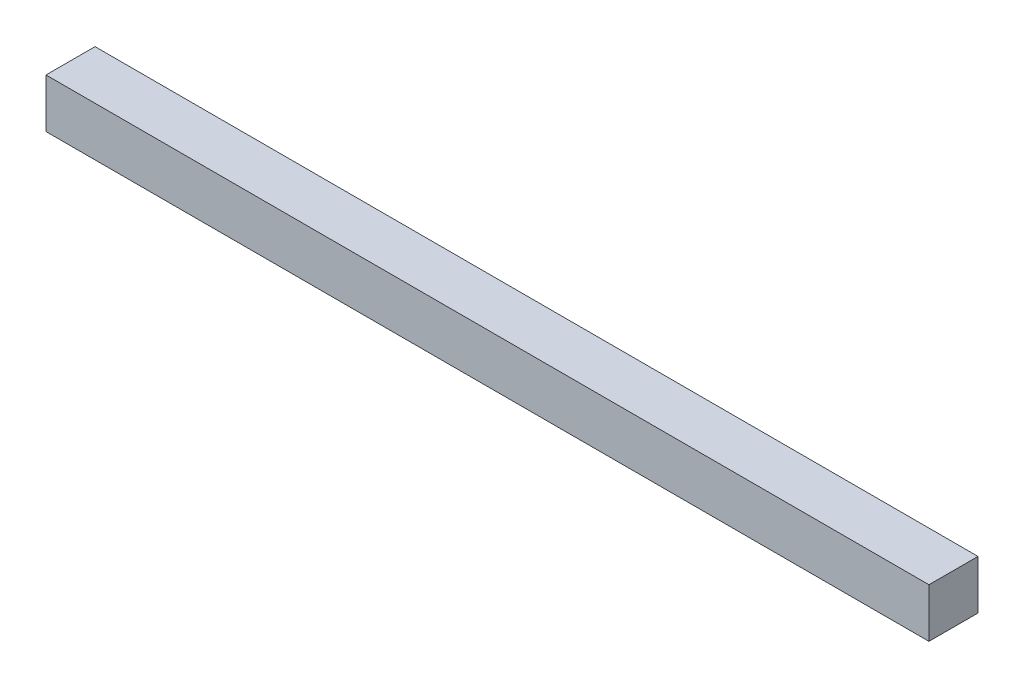
ISO-10303-21;
HEADER;
FILE_DESCRIPTION(('STEP AP214'),'2;1');
FILE_NAME('part.step','',(''),(''),'','','');
FILE_SCHEMA(('AUTOMOTIVE_DESIGN { 1 0 10303 214 1 1 1 1 }'));
ENDSEC;
DATA;
#1=APPLICATION_CONTEXT('core data for automotive mechanical design processes');
#2=APPLICATION_PROTOCOL_DEFINITION('international standard','automotive_design',2000,#1);
#3=PRODUCT_CONTEXT('',#1,'mechanical');
#4=PRODUCT('Part','Part','',(#3));
#5=PRODUCT_RELATED_PRODUCT_CATEGORY('part','',(#4));
#6=PRODUCT_DEFINITION_FORMATION('','',#4);
#7=PRODUCT_DEFINITION_CONTEXT('part definition',#1,'design');
#8=PRODUCT_DEFINITION('design','',#6,#7);
#9=PRODUCT_DEFINITION_SHAPE('','',#8);
#10=(LENGTH_UNIT() NAMED_UNIT(*) SI_UNIT(.MILLI.,.METRE.));
#11=(NAMED_UNIT(*) PLANE_ANGLE_UNIT() SI_UNIT($,.RADIAN.));
#12=(NAMED_UNIT(*) SI_UNIT($,.STERADIAN.) SOLID_ANGLE_UNIT());
#13=UNCERTAINTY_MEASURE_WITH_UNIT(LENGTH_MEASURE(1.E-05),#10,'distance_accuracy_value','');
#14=(GEOMETRIC_REPRESENTATION_CONTEXT(3) GLOBAL_UNCERTAINTY_ASSIGNED_CONTEXT((#13)) GLOBAL_UNIT_ASSIGNED_CONTEXT((#10,
#11,#12)) REPRESENTATION_CONTEXT('',''));
#15=CARTESIAN_POINT('',(0.,0.,0.));
#16=DIRECTION('',(0.,0.,1.));
#17=DIRECTION('',(1.,0.,0.));
#18=AXIS2_PLACEMENT_3D('',#15,#16,#17);
#19=CARTESIAN_POINT('',(685.8,19.05,-19.05));
#20=DIRECTION('',(0.,0.,1.));
#21=DIRECTION('',(0.,-1.,0.));
#22=AXIS2_PLACEMENT_3D('',#19,#20,#21);
#23=PLANE('',#22);
#24=DIRECTION('',(0.,1.,0.));
#25=VECTOR('',#24,1.);
#26=CARTESIAN_POINT('',(0.,19.05,-19.05));
#27=LINE('',#26,#25);
#28=CARTESIAN_POINT('',(0.,-19.05,-19.05));
#29=VERTEX_POINT('',#28);
#30=CARTESIAN_POINT('',(0.,19.05,-19.05));
#31=VERTEX_POINT('',#30);
#32=EDGE_CURVE('E107',#29,#31,#27,.T.);
#33=ORIENTED_EDGE('',*,*,#32,.T.);
#34=DIRECTION('',(-1.,0.,0.));
#35=VECTOR('',#34,1.);
#36=CARTESIAN_POINT('',(685.8,19.05,-19.05));
#37=LINE('',#36,#35);
#38=CARTESIAN_POINT('',(685.8,19.05,-19.05));
#39=VERTEX_POINT('',#38);
#40=EDGE_CURVE('E11',#39,#31,#37,.T.);
#41=ORIENTED_EDGE('',*,*,#40,.F.);
#42=DIRECTION('',(0.,1.,0.));
#43=VECTOR('',#42,1.);
#44=CARTESIAN_POINT('',(685.8,19.05,-19.05));
#45=LINE('',#44,#43);
#46=CARTESIAN_POINT('',(685.8,-19.05,-19.05));
#47=VERTEX_POINT('',#46);
#48=EDGE_CURVE('E91',#47,#39,#45,.T.);
#49=ORIENTED_EDGE('',*,*,#48,.F.);
#50=DIRECTION('',(-1.,0.,0.));
#51=VECTOR('',#50,1.);
#52=CARTESIAN_POINT('',(685.8,-19.05,-19.05));
#53=LINE('',#52,#51);
#54=EDGE_CURVE('E103',#47,#29,#53,.T.);
#55=ORIENTED_EDGE('',*,*,#54,.T.);
#56=EDGE_LOOP('',(#33,#41,#49,#55));
#57=FACE_BOUND('',#56,.T.);
#58=ADVANCED_FACE('F39',(#57),#23,.F.);
#59=CARTESIAN_POINT('',(685.8,19.05,19.05));
#60=DIRECTION('',(0.,-1.,0.));
#61=DIRECTION('',(0.,0.,-1.));
#62=AXIS2_PLACEMENT_3D('',#59,#60,#61);
#63=PLANE('',#62);
#64=DIRECTION('',(0.,0.,1.));
#65=VECTOR('',#64,1.);
#66=CARTESIAN_POINT('',(0.,19.05,19.05));
#67=LINE('',#66,#65);
#68=CARTESIAN_POINT('',(0.,19.05,19.05));
#69=VERTEX_POINT('',#68);
#70=EDGE_CURVE('E96',#31,#69,#67,.T.);
#71=ORIENTED_EDGE('',*,*,#70,.T.);
#72=DIRECTION('',(-1.,0.,0.));
#73=VECTOR('',#72,1.);
#74=CARTESIAN_POINT('',(685.8,19.05,19.05));
#75=LINE('',#74,#73);
#76=CARTESIAN_POINT('',(685.8,19.05,19.05));
#77=VERTEX_POINT('',#76);
#78=EDGE_CURVE('E48',#77,#69,#75,.T.);
#79=ORIENTED_EDGE('',*,*,#78,.F.);
#80=DIRECTION('',(0.,0.,1.));
#81=VECTOR('',#80,1.);
#82=CARTESIAN_POINT('',(685.8,19.05,19.05));
#83=LINE('',#82,#81);
#84=EDGE_CURVE('E86',#39,#77,#83,.T.);
#85=ORIENTED_EDGE('',*,*,#84,.F.);
#86=ORIENTED_EDGE('',*,*,#40,.T.);
#87=EDGE_LOOP('',(#71,#79,#85,#86));
#88=FACE_BOUND('',#87,.T.);
#89=ADVANCED_FACE('F95',(#88),#63,.F.);
#90=CARTESIAN_POINT('',(685.8,19.05,19.05));
#91=DIRECTION('',(0.,0.,-1.));
#92=DIRECTION('',(0.,1.,0.));
#93=AXIS2_PLACEMENT_3D('',#90,#91,#92);
#94=PLANE('',#93);
#95=DIRECTION('',(0.,-1.,0.));
#96=VECTOR('',#95,1.);
#97=CARTESIAN_POINT('',(0.,19.05,19.05));
#98=LINE('',#97,#96);
#99=CARTESIAN_POINT('',(0.,-19.05,19.05));
#100=VERTEX_POINT('',#99);
#101=EDGE_CURVE('E73',#69,#100,#98,.T.);
#102=ORIENTED_EDGE('',*,*,#101,.T.);
#103=DIRECTION('',(-1.,0.,0.));
#104=VECTOR('',#103,1.);
#105=CARTESIAN_POINT('',(685.8,-19.05,19.05));
#106=LINE('',#105,#104);
#107=CARTESIAN_POINT('',(685.8,-19.05,19.05));
#108=VERTEX_POINT('',#107);
#109=EDGE_CURVE('E98',#108,#100,#106,.T.);
#110=ORIENTED_EDGE('',*,*,#109,.F.);
#111=DIRECTION('',(0.,-1.,0.));
#112=VECTOR('',#111,1.);
#113=CARTESIAN_POINT('',(685.8,19.05,19.05));
#114=LINE('',#113,#112);
#115=EDGE_CURVE('E89',#77,#108,#114,.T.);
#116=ORIENTED_EDGE('',*,*,#115,.F.);
#117=ORIENTED_EDGE('',*,*,#78,.T.);
#118=EDGE_LOOP('',(#102,#110,#116,#117));
#119=FACE_BOUND('',#118,.T.);
#120=ADVANCED_FACE('F99',(#119),#94,.F.);
#121=CARTESIAN_POINT('',(685.8,-19.05,19.05));
#122=DIRECTION('',(0.,1.,0.));
#123=DIRECTION('',(0.,0.,1.));
#124=AXIS2_PLACEMENT_3D('',#121,#122,#123);
#125=PLANE('',#124);
#126=DIRECTION('',(0.,0.,-1.));
#127=VECTOR('',#126,1.);
#128=CARTESIAN_POINT('',(0.,-19.05,19.05));
#129=LINE('',#128,#127);
#130=EDGE_CURVE('E79',#100,#29,#129,.T.);
#131=ORIENTED_EDGE('',*,*,#130,.T.);
#132=ORIENTED_EDGE('',*,*,#54,.F.);
#133=DIRECTION('',(0.,0.,-1.));
#134=VECTOR('',#133,1.);
#135=CARTESIAN_POINT('',(685.8,-19.05,19.05));
#136=LINE('',#135,#134);
#137=EDGE_CURVE('E56',#108,#47,#136,.T.);
#138=ORIENTED_EDGE('',*,*,#137,.F.);
#139=ORIENTED_EDGE('',*,*,#109,.T.);
#140=EDGE_LOOP('',(#131,#132,#138,#139));
#141=FACE_BOUND('',#140,.T.);
#142=ADVANCED_FACE('F120',(#141),#125,.F.);
#143=CARTESIAN_POINT('',(685.8,0.,0.));
#144=DIRECTION('',(1.,0.,0.));
#145=DIRECTION('',(0.,0.,-1.));
#146=AXIS2_PLACEMENT_3D('',#143,#144,#145);
#147=PLANE('',#146);
#148=ORIENTED_EDGE('',*,*,#48,.T.);
#149=ORIENTED_EDGE('',*,*,#84,.T.);
#150=ORIENTED_EDGE('',*,*,#115,.T.);
#151=ORIENTED_EDGE('',*,*,#137,.T.);
#152=EDGE_LOOP('',(#148,#149,#150,#151));
#153=FACE_BOUND('',#152,.T.);
#154=ADVANCED_FACE('F87',(#153),#147,.T.);
#155=CARTESIAN_POINT('',(0.,0.,0.));
#156=DIRECTION('',(1.,0.,0.));
#157=DIRECTION('',(0.,0.,-1.));
#158=AXIS2_PLACEMENT_3D('',#155,#156,#157);
#159=PLANE('',#158);
#160=ORIENTED_EDGE('',*,*,#32,.F.);
#161=ORIENTED_EDGE('',*,*,#130,.F.);
#162=ORIENTED_EDGE('',*,*,#101,.F.);
#163=ORIENTED_EDGE('',*,*,#70,.F.);
#164=EDGE_LOOP('',(#160,#161,#162,#163));
#165=FACE_BOUND('',#164,.T.);
#166=ADVANCED_FACE('F123',(#165),#159,.F.);
#167=CLOSED_SHELL('',(#58,#89,#120,#142,#154,#166));
#168=MANIFOLD_SOLID_BREP('B2',#167);
#169=ADVANCED_BREP_SHAPE_REPRESENTATION('',(#18,#168),#14);
#170=SHAPE_DEFINITION_REPRESENTATION(#9,#169);
ENDSEC;
END-ISO-10303-21;
